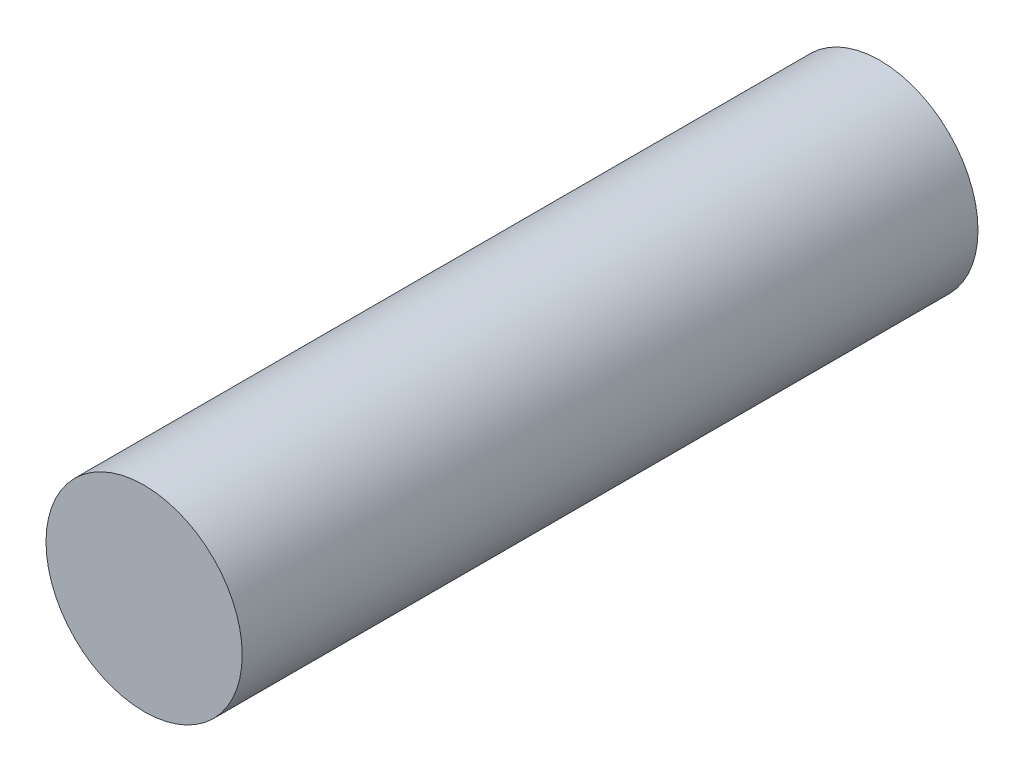
ISO-10303-21;
HEADER;
FILE_DESCRIPTION(('STEP AP214'),'2;1');
FILE_NAME('part.step','',(''),(''),'','','');
FILE_SCHEMA(('AUTOMOTIVE_DESIGN { 1 0 10303 214 1 1 1 1 }'));
ENDSEC;
DATA;
#1=APPLICATION_CONTEXT('core data for automotive mechanical design processes');
#2=APPLICATION_PROTOCOL_DEFINITION('international standard','automotive_design',2000,#1);
#3=PRODUCT_CONTEXT('',#1,'mechanical');
#4=PRODUCT('Part','Part','',(#3));
#5=PRODUCT_RELATED_PRODUCT_CATEGORY('part','',(#4));
#6=PRODUCT_DEFINITION_FORMATION('','',#4);
#7=PRODUCT_DEFINITION_CONTEXT('part definition',#1,'design');
#8=PRODUCT_DEFINITION('design','',#6,#7);
#9=PRODUCT_DEFINITION_SHAPE('','',#8);
#10=(LENGTH_UNIT() NAMED_UNIT(*) SI_UNIT(.MILLI.,.METRE.));
#11=(NAMED_UNIT(*) PLANE_ANGLE_UNIT() SI_UNIT($,.RADIAN.));
#12=(NAMED_UNIT(*) SI_UNIT($,.STERADIAN.) SOLID_ANGLE_UNIT());
#13=UNCERTAINTY_MEASURE_WITH_UNIT(LENGTH_MEASURE(1.E-05),#10,'distance_accuracy_value','');
#14=(GEOMETRIC_REPRESENTATION_CONTEXT(3) GLOBAL_UNCERTAINTY_ASSIGNED_CONTEXT((#13)) GLOBAL_UNIT_ASSIGNED_CONTEXT((#10,
#11,#12)) REPRESENTATION_CONTEXT('',''));
#15=CARTESIAN_POINT('',(0.,0.,0.));
#16=DIRECTION('',(0.,0.,1.));
#17=DIRECTION('',(1.,0.,0.));
#18=AXIS2_PLACEMENT_3D('',#15,#16,#17);
#19=CARTESIAN_POINT('',(0.,0.,30.));
#20=DIRECTION('',(0.,0.,-1.));
#21=DIRECTION('',(-1.,0.,0.));
#22=AXIS2_PLACEMENT_3D('',#19,#20,#21);
#23=CYLINDRICAL_SURFACE('',#22,4.);
#24=CARTESIAN_POINT('',(0.,0.,30.));
#25=DIRECTION('',(0.,0.,1.));
#26=DIRECTION('',(1.,0.,0.));
#27=AXIS2_PLACEMENT_3D('',#24,#25,#26);
#28=CIRCLE('',#27,4.);
#29=CARTESIAN_POINT('',(4.,0.,30.));
#30=VERTEX_POINT('',#29);
#31=EDGE_CURVE('E10',#30,#30,#28,.T.);
#32=ORIENTED_EDGE('',*,*,#31,.F.);
#33=EDGE_LOOP('',(#32));
#34=FACE_BOUND('',#33,.T.);
#35=CARTESIAN_POINT('',(0.,0.,0.));
#36=DIRECTION('',(0.,0.,1.));
#37=DIRECTION('',(1.,0.,0.));
#38=AXIS2_PLACEMENT_3D('',#35,#36,#37);
#39=CIRCLE('',#38,4.);
#40=CARTESIAN_POINT('',(4.,0.,0.));
#41=VERTEX_POINT('',#40);
#42=EDGE_CURVE('E37',#41,#41,#39,.T.);
#43=ORIENTED_EDGE('',*,*,#42,.T.);
#44=EDGE_LOOP('',(#43));
#45=FACE_BOUND('',#44,.T.);
#46=ADVANCED_FACE('F34',(#34,#45),#23,.T.);
#47=CARTESIAN_POINT('',(0.,0.,30.));
#48=DIRECTION('',(0.,0.,1.));
#49=DIRECTION('',(1.,0.,0.));
#50=AXIS2_PLACEMENT_3D('',#47,#48,#49);
#51=PLANE('',#50);
#52=ORIENTED_EDGE('',*,*,#31,.T.);
#53=EDGE_LOOP('',(#52));
#54=FACE_BOUND('',#53,.T.);
#55=ADVANCED_FACE('F49',(#54),#51,.T.);
#56=CARTESIAN_POINT('',(0.,0.,0.));
#57=DIRECTION('',(0.,0.,1.));
#58=DIRECTION('',(1.,0.,0.));
#59=AXIS2_PLACEMENT_3D('',#56,#57,#58);
#60=PLANE('',#59);
#61=ORIENTED_EDGE('',*,*,#42,.F.);
#62=EDGE_LOOP('',(#61));
#63=FACE_BOUND('',#62,.T.);
#64=ADVANCED_FACE('F47',(#63),#60,.F.);
#65=CLOSED_SHELL('',(#46,#55,#64));
#66=MANIFOLD_SOLID_BREP('B2',#65);
#67=ADVANCED_BREP_SHAPE_REPRESENTATION('',(#18,#66),#14);
#68=SHAPE_DEFINITION_REPRESENTATION(#9,#67);
ENDSEC;
END-ISO-10303-21;
